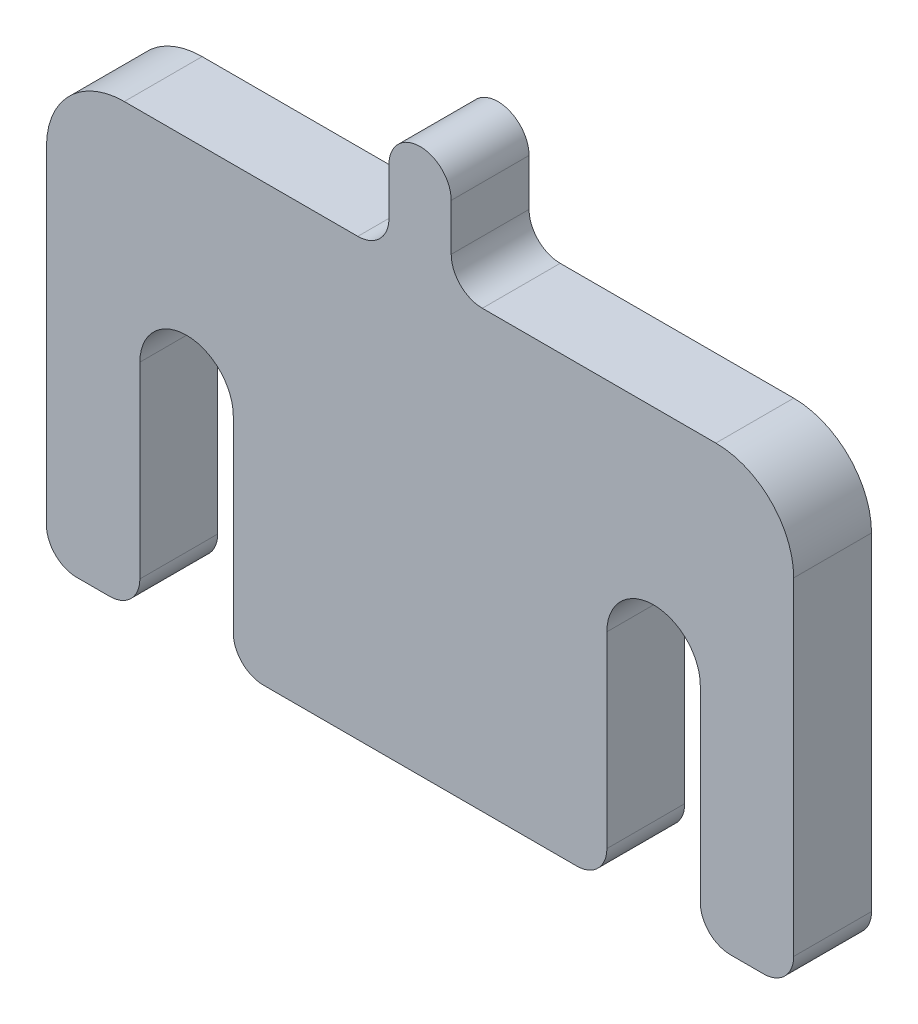
ISO-10303-21;
HEADER;
FILE_DESCRIPTION(('STEP AP214'),'2;1');
FILE_NAME('part.step','',(''),(''),'','','');
FILE_SCHEMA(('AUTOMOTIVE_DESIGN { 1 0 10303 214 1 1 1 1 }'));
ENDSEC;
DATA;
#1=APPLICATION_CONTEXT('core data for automotive mechanical design processes');
#2=APPLICATION_PROTOCOL_DEFINITION('international standard','automotive_design',2000,#1);
#3=PRODUCT_CONTEXT('',#1,'mechanical');
#4=PRODUCT('Part','Part','',(#3));
#5=PRODUCT_RELATED_PRODUCT_CATEGORY('part','',(#4));
#6=PRODUCT_DEFINITION_FORMATION('','',#4);
#7=PRODUCT_DEFINITION_CONTEXT('part definition',#1,'design');
#8=PRODUCT_DEFINITION('design','',#6,#7);
#9=PRODUCT_DEFINITION_SHAPE('','',#8);
#10=(LENGTH_UNIT() NAMED_UNIT(*) SI_UNIT(.MILLI.,.METRE.));
#11=(NAMED_UNIT(*) PLANE_ANGLE_UNIT() SI_UNIT($,.RADIAN.));
#12=(NAMED_UNIT(*) SI_UNIT($,.STERADIAN.) SOLID_ANGLE_UNIT());
#13=UNCERTAINTY_MEASURE_WITH_UNIT(LENGTH_MEASURE(1.E-05),#10,'distance_accuracy_value','');
#14=(GEOMETRIC_REPRESENTATION_CONTEXT(3) GLOBAL_UNCERTAINTY_ASSIGNED_CONTEXT((#13)) GLOBAL_UNIT_ASSIGNED_CONTEXT((#10,
#11,#12)) REPRESENTATION_CONTEXT('',''));
#15=CARTESIAN_POINT('',(0.,0.,0.));
#16=DIRECTION('',(0.,0.,1.));
#17=DIRECTION('',(1.,0.,0.));
#18=AXIS2_PLACEMENT_3D('',#15,#16,#17);
#19=CARTESIAN_POINT('',(0.,14.,5.));
#20=DIRECTION('',(0.,-1.,0.));
#21=DIRECTION('',(1.,0.,0.));
#22=AXIS2_PLACEMENT_3D('',#19,#20,#21);
#23=PLANE('',#22);
#24=DIRECTION('',(-1.,0.,0.));
#25=VECTOR('',#24,1.);
#26=CARTESIAN_POINT('',(0.,14.,0.));
#27=LINE('',#26,#25);
#28=CARTESIAN_POINT('',(19.,14.,0.));
#29=VERTEX_POINT('',#28);
#30=CARTESIAN_POINT('',(4.,14.,0.));
#31=VERTEX_POINT('',#30);
#32=EDGE_CURVE('E239',#29,#31,#27,.T.);
#33=ORIENTED_EDGE('',*,*,#32,.T.);
#34=DIRECTION('',(0.,0.,-1.));
#35=VECTOR('',#34,1.);
#36=CARTESIAN_POINT('',(4.,14.,5.));
#37=LINE('',#36,#35);
#38=CARTESIAN_POINT('',(4.,14.,5.));
#39=VERTEX_POINT('',#38);
#40=EDGE_CURVE('E11',#39,#31,#37,.T.);
#41=ORIENTED_EDGE('',*,*,#40,.F.);
#42=DIRECTION('',(-1.,0.,0.));
#43=VECTOR('',#42,1.);
#44=CARTESIAN_POINT('',(0.,14.,5.));
#45=LINE('',#44,#43);
#46=CARTESIAN_POINT('',(19.,14.,5.));
#47=VERTEX_POINT('',#46);
#48=EDGE_CURVE('E308',#47,#39,#45,.T.);
#49=ORIENTED_EDGE('',*,*,#48,.F.);
#50=DIRECTION('',(0.,0.,-1.));
#51=VECTOR('',#50,1.);
#52=CARTESIAN_POINT('',(19.,14.,5.));
#53=LINE('',#52,#51);
#54=EDGE_CURVE('E235',#47,#29,#53,.T.);
#55=ORIENTED_EDGE('',*,*,#54,.T.);
#56=EDGE_LOOP('',(#33,#41,#49,#55));
#57=FACE_BOUND('',#56,.T.);
#58=ADVANCED_FACE('F36',(#57),#23,.F.);
#59=CARTESIAN_POINT('',(4.,16.,5.));
#60=DIRECTION('',(0.,0.,-1.));
#61=DIRECTION('',(-1.,0.,0.));
#62=AXIS2_PLACEMENT_3D('',#59,#60,#61);
#63=CYLINDRICAL_SURFACE('',#62,2.);
#64=CARTESIAN_POINT('',(4.,16.,0.));
#65=DIRECTION('',(0.,0.,1.));
#66=DIRECTION('',(1.,0.,0.));
#67=AXIS2_PLACEMENT_3D('',#64,#65,#66);
#68=CIRCLE('',#67,2.);
#69=CARTESIAN_POINT('',(2.,16.,0.));
#70=VERTEX_POINT('',#69);
#71=EDGE_CURVE('E242',#31,#70,#68,.F.);
#72=ORIENTED_EDGE('',*,*,#71,.T.);
#73=DIRECTION('',(0.,0.,-1.));
#74=VECTOR('',#73,1.);
#75=CARTESIAN_POINT('',(2.,16.,5.));
#76=LINE('',#75,#74);
#77=CARTESIAN_POINT('',(2.,16.,5.));
#78=VERTEX_POINT('',#77);
#79=EDGE_CURVE('E44',#78,#70,#76,.T.);
#80=ORIENTED_EDGE('',*,*,#79,.F.);
#81=CARTESIAN_POINT('',(4.,16.,5.));
#82=DIRECTION('',(0.,0.,1.));
#83=DIRECTION('',(1.,0.,0.));
#84=AXIS2_PLACEMENT_3D('',#81,#82,#83);
#85=CIRCLE('',#84,2.);
#86=EDGE_CURVE('E149',#39,#78,#85,.F.);
#87=ORIENTED_EDGE('',*,*,#86,.F.);
#88=ORIENTED_EDGE('',*,*,#40,.T.);
#89=EDGE_LOOP('',(#72,#80,#87,#88));
#90=FACE_BOUND('',#89,.T.);
#91=ADVANCED_FACE('F360',(#90),#63,.F.);
#92=CARTESIAN_POINT('',(1.99999999999999,0.,5.));
#93=DIRECTION('',(1.,0.,0.));
#94=DIRECTION('',(0.,1.,0.));
#95=AXIS2_PLACEMENT_3D('',#92,#93,#94);
#96=PLANE('',#95);
#97=DIRECTION('',(0.,-1.,0.));
#98=VECTOR('',#97,1.);
#99=CARTESIAN_POINT('',(1.99999999999999,0.,0.));
#100=LINE('',#99,#98);
#101=CARTESIAN_POINT('',(2.,19.,0.));
#102=VERTEX_POINT('',#101);
#103=EDGE_CURVE('E245',#102,#70,#100,.T.);
#104=ORIENTED_EDGE('',*,*,#103,.F.);
#105=DIRECTION('',(0.,0.,-1.));
#106=VECTOR('',#105,1.);
#107=CARTESIAN_POINT('',(2.,19.,5.));
#108=LINE('',#107,#106);
#109=CARTESIAN_POINT('',(2.,19.,5.));
#110=VERTEX_POINT('',#109);
#111=EDGE_CURVE('E353',#110,#102,#108,.T.);
#112=ORIENTED_EDGE('',*,*,#111,.F.);
#113=DIRECTION('',(0.,-1.,0.));
#114=VECTOR('',#113,1.);
#115=CARTESIAN_POINT('',(1.99999999999999,0.,5.));
#116=LINE('',#115,#114);
#117=EDGE_CURVE('E359',#110,#78,#116,.T.);
#118=ORIENTED_EDGE('',*,*,#117,.T.);
#119=ORIENTED_EDGE('',*,*,#79,.T.);
#120=EDGE_LOOP('',(#104,#112,#118,#119));
#121=FACE_BOUND('',#120,.T.);
#122=ADVANCED_FACE('F357',(#121),#96,.T.);
#123=CARTESIAN_POINT('',(0.,19.,5.));
#124=DIRECTION('',(0.,0.,-1.));
#125=DIRECTION('',(-1.,0.,0.));
#126=AXIS2_PLACEMENT_3D('',#123,#124,#125);
#127=CYLINDRICAL_SURFACE('',#126,2.);
#128=CARTESIAN_POINT('',(0.,19.,0.));
#129=DIRECTION('',(0.,0.,1.));
#130=DIRECTION('',(1.,0.,0.));
#131=AXIS2_PLACEMENT_3D('',#128,#129,#130);
#132=CIRCLE('',#131,2.);
#133=CARTESIAN_POINT('',(-2.,19.,0.));
#134=VERTEX_POINT('',#133);
#135=EDGE_CURVE('E248',#102,#134,#132,.T.);
#136=ORIENTED_EDGE('',*,*,#135,.T.);
#137=DIRECTION('',(0.,0.,-1.));
#138=VECTOR('',#137,1.);
#139=CARTESIAN_POINT('',(-2.,19.,5.));
#140=LINE('',#139,#138);
#141=CARTESIAN_POINT('',(-2.,19.,5.));
#142=VERTEX_POINT('',#141);
#143=EDGE_CURVE('E350',#142,#134,#140,.T.);
#144=ORIENTED_EDGE('',*,*,#143,.F.);
#145=CARTESIAN_POINT('',(0.,19.,5.));
#146=DIRECTION('',(0.,0.,1.));
#147=DIRECTION('',(1.,0.,0.));
#148=AXIS2_PLACEMENT_3D('',#145,#146,#147);
#149=CIRCLE('',#148,2.);
#150=EDGE_CURVE('E379',#110,#142,#149,.T.);
#151=ORIENTED_EDGE('',*,*,#150,.F.);
#152=ORIENTED_EDGE('',*,*,#111,.T.);
#153=EDGE_LOOP('',(#136,#144,#151,#152));
#154=FACE_BOUND('',#153,.T.);
#155=ADVANCED_FACE('F369',(#154),#127,.T.);
#156=CARTESIAN_POINT('',(-1.99999999999999,0.,5.));
#157=DIRECTION('',(1.,0.,0.));
#158=DIRECTION('',(0.,1.,0.));
#159=AXIS2_PLACEMENT_3D('',#156,#157,#158);
#160=PLANE('',#159);
#161=DIRECTION('',(0.,-1.,0.));
#162=VECTOR('',#161,1.);
#163=CARTESIAN_POINT('',(-1.99999999999999,0.,0.));
#164=LINE('',#163,#162);
#165=CARTESIAN_POINT('',(-2.,16.,0.));
#166=VERTEX_POINT('',#165);
#167=EDGE_CURVE('E250',#134,#166,#164,.T.);
#168=ORIENTED_EDGE('',*,*,#167,.T.);
#169=DIRECTION('',(0.,0.,-1.));
#170=VECTOR('',#169,1.);
#171=CARTESIAN_POINT('',(-2.,16.,5.));
#172=LINE('',#171,#170);
#173=CARTESIAN_POINT('',(-2.,16.,5.));
#174=VERTEX_POINT('',#173);
#175=EDGE_CURVE('E348',#174,#166,#172,.T.);
#176=ORIENTED_EDGE('',*,*,#175,.F.);
#177=DIRECTION('',(0.,-1.,0.));
#178=VECTOR('',#177,1.);
#179=CARTESIAN_POINT('',(-1.99999999999999,0.,5.));
#180=LINE('',#179,#178);
#181=EDGE_CURVE('E375',#142,#174,#180,.T.);
#182=ORIENTED_EDGE('',*,*,#181,.F.);
#183=ORIENTED_EDGE('',*,*,#143,.T.);
#184=EDGE_LOOP('',(#168,#176,#182,#183));
#185=FACE_BOUND('',#184,.T.);
#186=ADVANCED_FACE('F373',(#185),#160,.F.);
#187=CARTESIAN_POINT('',(-4.,16.,5.));
#188=DIRECTION('',(0.,0.,-1.));
#189=DIRECTION('',(-1.,0.,0.));
#190=AXIS2_PLACEMENT_3D('',#187,#188,#189);
#191=CYLINDRICAL_SURFACE('',#190,2.);
#192=CARTESIAN_POINT('',(-4.,16.,0.));
#193=DIRECTION('',(0.,0.,1.));
#194=DIRECTION('',(1.,0.,0.));
#195=AXIS2_PLACEMENT_3D('',#192,#193,#194);
#196=CIRCLE('',#195,2.);
#197=CARTESIAN_POINT('',(-4.,14.,0.));
#198=VERTEX_POINT('',#197);
#199=EDGE_CURVE('E253',#198,#166,#196,.T.);
#200=ORIENTED_EDGE('',*,*,#199,.F.);
#201=DIRECTION('',(0.,0.,-1.));
#202=VECTOR('',#201,1.);
#203=CARTESIAN_POINT('',(-4.,14.,5.));
#204=LINE('',#203,#202);
#205=CARTESIAN_POINT('',(-4.,14.,5.));
#206=VERTEX_POINT('',#205);
#207=EDGE_CURVE('E346',#206,#198,#204,.T.);
#208=ORIENTED_EDGE('',*,*,#207,.F.);
#209=CARTESIAN_POINT('',(-4.,16.,5.));
#210=DIRECTION('',(0.,0.,1.));
#211=DIRECTION('',(1.,0.,0.));
#212=AXIS2_PLACEMENT_3D('',#209,#210,#211);
#213=CIRCLE('',#212,2.);
#214=EDGE_CURVE('E378',#206,#174,#213,.T.);
#215=ORIENTED_EDGE('',*,*,#214,.T.);
#216=ORIENTED_EDGE('',*,*,#175,.T.);
#217=EDGE_LOOP('',(#200,#208,#215,#216));
#218=FACE_BOUND('',#217,.T.);
#219=ADVANCED_FACE('F454',(#218),#191,.F.);
#220=CARTESIAN_POINT('',(0.,14.,5.));
#221=DIRECTION('',(0.,-1.,0.));
#222=DIRECTION('',(1.,0.,0.));
#223=AXIS2_PLACEMENT_3D('',#220,#221,#222);
#224=PLANE('',#223);
#225=DIRECTION('',(-1.,0.,0.));
#226=VECTOR('',#225,1.);
#227=CARTESIAN_POINT('',(0.,14.,0.));
#228=LINE('',#227,#226);
#229=CARTESIAN_POINT('',(-19.,14.,0.));
#230=VERTEX_POINT('',#229);
#231=EDGE_CURVE('E256',#198,#230,#228,.T.);
#232=ORIENTED_EDGE('',*,*,#231,.T.);
#233=DIRECTION('',(0.,0.,-1.));
#234=VECTOR('',#233,1.);
#235=CARTESIAN_POINT('',(-19.,14.,5.));
#236=LINE('',#235,#234);
#237=CARTESIAN_POINT('',(-19.,14.,5.));
#238=VERTEX_POINT('',#237);
#239=EDGE_CURVE('E344',#238,#230,#236,.T.);
#240=ORIENTED_EDGE('',*,*,#239,.F.);
#241=DIRECTION('',(-1.,0.,0.));
#242=VECTOR('',#241,1.);
#243=CARTESIAN_POINT('',(0.,14.,5.));
#244=LINE('',#243,#242);
#245=EDGE_CURVE('E381',#206,#238,#244,.T.);
#246=ORIENTED_EDGE('',*,*,#245,.F.);
#247=ORIENTED_EDGE('',*,*,#207,.T.);
#248=EDGE_LOOP('',(#232,#240,#246,#247));
#249=FACE_BOUND('',#248,.T.);
#250=ADVANCED_FACE('F457',(#249),#224,.F.);
#251=CARTESIAN_POINT('',(-19.,9.,5.));
#252=DIRECTION('',(0.,0.,-1.));
#253=DIRECTION('',(-1.,0.,0.));
#254=AXIS2_PLACEMENT_3D('',#251,#252,#253);
#255=CYLINDRICAL_SURFACE('',#254,5.);
#256=CARTESIAN_POINT('',(-19.,9.,0.));
#257=DIRECTION('',(0.,0.,1.));
#258=DIRECTION('',(1.,0.,0.));
#259=AXIS2_PLACEMENT_3D('',#256,#257,#258);
#260=CIRCLE('',#259,5.);
#261=CARTESIAN_POINT('',(-24.,9.,0.));
#262=VERTEX_POINT('',#261);
#263=EDGE_CURVE('E259',#262,#230,#260,.F.);
#264=ORIENTED_EDGE('',*,*,#263,.F.);
#265=DIRECTION('',(0.,0.,-1.));
#266=VECTOR('',#265,1.);
#267=CARTESIAN_POINT('',(-24.,9.,5.));
#268=LINE('',#267,#266);
#269=CARTESIAN_POINT('',(-24.,9.,5.));
#270=VERTEX_POINT('',#269);
#271=EDGE_CURVE('E342',#270,#262,#268,.T.);
#272=ORIENTED_EDGE('',*,*,#271,.F.);
#273=CARTESIAN_POINT('',(-19.,9.,5.));
#274=DIRECTION('',(0.,0.,1.));
#275=DIRECTION('',(1.,0.,0.));
#276=AXIS2_PLACEMENT_3D('',#273,#274,#275);
#277=CIRCLE('',#276,5.);
#278=EDGE_CURVE('E387',#270,#238,#277,.F.);
#279=ORIENTED_EDGE('',*,*,#278,.T.);
#280=ORIENTED_EDGE('',*,*,#239,.T.);
#281=EDGE_LOOP('',(#264,#272,#279,#280));
#282=FACE_BOUND('',#281,.T.);
#283=ADVANCED_FACE('F461',(#282),#255,.T.);
#284=CARTESIAN_POINT('',(-24.,0.,5.));
#285=DIRECTION('',(-1.,0.,0.));
#286=DIRECTION('',(0.,0.,1.));
#287=AXIS2_PLACEMENT_3D('',#284,#285,#286);
#288=PLANE('',#287);
#289=DIRECTION('',(0.,1.,0.));
#290=VECTOR('',#289,1.);
#291=CARTESIAN_POINT('',(-24.,0.,0.));
#292=LINE('',#291,#290);
#293=CARTESIAN_POINT('',(-24.,-12.0597401295921,0.));
#294=VERTEX_POINT('',#293);
#295=EDGE_CURVE('E262',#294,#262,#292,.T.);
#296=ORIENTED_EDGE('',*,*,#295,.F.);
#297=DIRECTION('',(0.,0.,-1.));
#298=VECTOR('',#297,1.);
#299=CARTESIAN_POINT('',(-24.,-12.0597401295921,5.));
#300=LINE('',#299,#298);
#301=CARTESIAN_POINT('',(-24.,-12.0597401295921,5.));
#302=VERTEX_POINT('',#301);
#303=EDGE_CURVE('E340',#302,#294,#300,.T.);
#304=ORIENTED_EDGE('',*,*,#303,.F.);
#305=DIRECTION('',(0.,1.,0.));
#306=VECTOR('',#305,1.);
#307=CARTESIAN_POINT('',(-24.,0.,5.));
#308=LINE('',#307,#306);
#309=EDGE_CURVE('E390',#302,#270,#308,.T.);
#310=ORIENTED_EDGE('',*,*,#309,.T.);
#311=ORIENTED_EDGE('',*,*,#271,.T.);
#312=EDGE_LOOP('',(#296,#304,#310,#311));
#313=FACE_BOUND('',#312,.T.);
#314=ADVANCED_FACE('F465',(#313),#288,.T.);
#315=CARTESIAN_POINT('',(-22.0597401295921,-12.0597401295921,5.));
#316=DIRECTION('',(0.,0.,-1.));
#317=DIRECTION('',(-1.,0.,0.));
#318=AXIS2_PLACEMENT_3D('',#315,#316,#317);
#319=CYLINDRICAL_SURFACE('',#318,1.94025987040791);
#320=CARTESIAN_POINT('',(-22.0597401295921,-12.0597401295921,0.));
#321=DIRECTION('',(0.,0.,1.));
#322=DIRECTION('',(1.,0.,0.));
#323=AXIS2_PLACEMENT_3D('',#320,#321,#322);
#324=CIRCLE('',#323,1.94025987040791);
#325=CARTESIAN_POINT('',(-22.0597401295921,-14.,0.));
#326=VERTEX_POINT('',#325);
#327=EDGE_CURVE('E265',#294,#326,#324,.T.);
#328=ORIENTED_EDGE('',*,*,#327,.T.);
#329=DIRECTION('',(0.,0.,-1.));
#330=VECTOR('',#329,1.);
#331=CARTESIAN_POINT('',(-22.0597401295921,-14.,5.));
#332=LINE('',#331,#330);
#333=CARTESIAN_POINT('',(-22.0597401295921,-14.,5.));
#334=VERTEX_POINT('',#333);
#335=EDGE_CURVE('E338',#334,#326,#332,.T.);
#336=ORIENTED_EDGE('',*,*,#335,.F.);
#337=CARTESIAN_POINT('',(-22.0597401295921,-12.0597401295921,5.));
#338=DIRECTION('',(0.,0.,1.));
#339=DIRECTION('',(1.,0.,0.));
#340=AXIS2_PLACEMENT_3D('',#337,#338,#339);
#341=CIRCLE('',#340,1.94025987040791);
#342=EDGE_CURVE('E393',#302,#334,#341,.T.);
#343=ORIENTED_EDGE('',*,*,#342,.F.);
#344=ORIENTED_EDGE('',*,*,#303,.T.);
#345=EDGE_LOOP('',(#328,#336,#343,#344));
#346=FACE_BOUND('',#345,.T.);
#347=ADVANCED_FACE('F469',(#346),#319,.T.);
#348=CARTESIAN_POINT('',(0.,-14.,5.));
#349=DIRECTION('',(0.,-1.,0.));
#350=DIRECTION('',(0.,0.,-1.));
#351=AXIS2_PLACEMENT_3D('',#348,#349,#350);
#352=PLANE('',#351);
#353=DIRECTION('',(-1.,0.,0.));
#354=VECTOR('',#353,1.);
#355=CARTESIAN_POINT('',(0.,-14.,0.));
#356=LINE('',#355,#354);
#357=CARTESIAN_POINT('',(-19.9402598704079,-14.,0.));
#358=VERTEX_POINT('',#357);
#359=EDGE_CURVE('E268',#358,#326,#356,.T.);
#360=ORIENTED_EDGE('',*,*,#359,.F.);
#361=DIRECTION('',(0.,0.,-1.));
#362=VECTOR('',#361,1.);
#363=CARTESIAN_POINT('',(-19.9402598704079,-14.,5.));
#364=LINE('',#363,#362);
#365=CARTESIAN_POINT('',(-19.9402598704079,-14.,5.));
#366=VERTEX_POINT('',#365);
#367=EDGE_CURVE('E336',#366,#358,#364,.T.);
#368=ORIENTED_EDGE('',*,*,#367,.F.);
#369=DIRECTION('',(-1.,0.,0.));
#370=VECTOR('',#369,1.);
#371=CARTESIAN_POINT('',(0.,-14.,5.));
#372=LINE('',#371,#370);
#373=EDGE_CURVE('E395',#366,#334,#372,.T.);
#374=ORIENTED_EDGE('',*,*,#373,.T.);
#375=ORIENTED_EDGE('',*,*,#335,.T.);
#376=EDGE_LOOP('',(#360,#368,#374,#375));
#377=FACE_BOUND('',#376,.T.);
#378=ADVANCED_FACE('F473',(#377),#352,.T.);
#379=CARTESIAN_POINT('',(-19.9402598704079,-12.0597401295921,5.));
#380=DIRECTION('',(0.,0.,-1.));
#381=DIRECTION('',(-1.,0.,0.));
#382=AXIS2_PLACEMENT_3D('',#379,#380,#381);
#383=CYLINDRICAL_SURFACE('',#382,1.94025987040791);
#384=CARTESIAN_POINT('',(-19.9402598704079,-12.0597401295921,0.));
#385=DIRECTION('',(0.,0.,1.));
#386=DIRECTION('',(1.,0.,0.));
#387=AXIS2_PLACEMENT_3D('',#384,#385,#386);
#388=CIRCLE('',#387,1.94025987040791);
#389=CARTESIAN_POINT('',(-18.,-12.0597401295921,0.));
#390=VERTEX_POINT('',#389);
#391=EDGE_CURVE('E271',#358,#390,#388,.T.);
#392=ORIENTED_EDGE('',*,*,#391,.T.);
#393=DIRECTION('',(0.,0.,-1.));
#394=VECTOR('',#393,1.);
#395=CARTESIAN_POINT('',(-18.,-12.0597401295921,5.));
#396=LINE('',#395,#394);
#397=CARTESIAN_POINT('',(-18.,-12.0597401295921,5.));
#398=VERTEX_POINT('',#397);
#399=EDGE_CURVE('E334',#398,#390,#396,.T.);
#400=ORIENTED_EDGE('',*,*,#399,.F.);
#401=CARTESIAN_POINT('',(-19.9402598704079,-12.0597401295921,5.));
#402=DIRECTION('',(0.,0.,1.));
#403=DIRECTION('',(1.,0.,0.));
#404=AXIS2_PLACEMENT_3D('',#401,#402,#403);
#405=CIRCLE('',#404,1.94025987040791);
#406=EDGE_CURVE('E398',#366,#398,#405,.T.);
#407=ORIENTED_EDGE('',*,*,#406,.F.);
#408=ORIENTED_EDGE('',*,*,#367,.T.);
#409=EDGE_LOOP('',(#392,#400,#407,#408));
#410=FACE_BOUND('',#409,.T.);
#411=ADVANCED_FACE('F477',(#410),#383,.T.);
#412=CARTESIAN_POINT('',(-18.,0.,5.));
#413=DIRECTION('',(1.,0.,0.));
#414=DIRECTION('',(0.,1.,0.));
#415=AXIS2_PLACEMENT_3D('',#412,#413,#414);
#416=PLANE('',#415);
#417=DIRECTION('',(0.,-1.,0.));
#418=VECTOR('',#417,1.);
#419=CARTESIAN_POINT('',(-18.,0.,0.));
#420=LINE('',#419,#418);
#421=CARTESIAN_POINT('',(-18.,0.,0.));
#422=VERTEX_POINT('',#421);
#423=EDGE_CURVE('E274',#422,#390,#420,.T.);
#424=ORIENTED_EDGE('',*,*,#423,.F.);
#425=DIRECTION('',(0.,0.,-1.));
#426=VECTOR('',#425,1.);
#427=CARTESIAN_POINT('',(-18.,0.,5.));
#428=LINE('',#427,#426);
#429=CARTESIAN_POINT('',(-18.,0.,5.));
#430=VERTEX_POINT('',#429);
#431=EDGE_CURVE('E332',#430,#422,#428,.T.);
#432=ORIENTED_EDGE('',*,*,#431,.F.);
#433=DIRECTION('',(0.,-1.,0.));
#434=VECTOR('',#433,1.);
#435=CARTESIAN_POINT('',(-18.,0.,5.));
#436=LINE('',#435,#434);
#437=EDGE_CURVE('E400',#430,#398,#436,.T.);
#438=ORIENTED_EDGE('',*,*,#437,.T.);
#439=ORIENTED_EDGE('',*,*,#399,.T.);
#440=EDGE_LOOP('',(#424,#432,#438,#439));
#441=FACE_BOUND('',#440,.T.);
#442=ADVANCED_FACE('F481',(#441),#416,.T.);
#443=CARTESIAN_POINT('',(-15.,0.,5.));
#444=DIRECTION('',(0.,0.,-1.));
#445=DIRECTION('',(-1.,0.,0.));
#446=AXIS2_PLACEMENT_3D('',#443,#444,#445);
#447=CYLINDRICAL_SURFACE('',#446,3.);
#448=CARTESIAN_POINT('',(-15.,0.,0.));
#449=DIRECTION('',(0.,0.,1.));
#450=DIRECTION('',(1.,0.,0.));
#451=AXIS2_PLACEMENT_3D('',#448,#449,#450);
#452=CIRCLE('',#451,3.);
#453=CARTESIAN_POINT('',(-12.,0.,0.));
#454=VERTEX_POINT('',#453);
#455=EDGE_CURVE('E277',#454,#422,#452,.T.);
#456=ORIENTED_EDGE('',*,*,#455,.F.);
#457=DIRECTION('',(0.,0.,-1.));
#458=VECTOR('',#457,1.);
#459=CARTESIAN_POINT('',(-12.,0.,5.));
#460=LINE('',#459,#458);
#461=CARTESIAN_POINT('',(-12.,0.,5.));
#462=VERTEX_POINT('',#461);
#463=EDGE_CURVE('E330',#462,#454,#460,.T.);
#464=ORIENTED_EDGE('',*,*,#463,.F.);
#465=CARTESIAN_POINT('',(-15.,0.,5.));
#466=DIRECTION('',(0.,0.,1.));
#467=DIRECTION('',(1.,0.,0.));
#468=AXIS2_PLACEMENT_3D('',#465,#466,#467);
#469=CIRCLE('',#468,3.);
#470=EDGE_CURVE('E403',#462,#430,#469,.T.);
#471=ORIENTED_EDGE('',*,*,#470,.T.);
#472=ORIENTED_EDGE('',*,*,#431,.T.);
#473=EDGE_LOOP('',(#456,#464,#471,#472));
#474=FACE_BOUND('',#473,.T.);
#475=ADVANCED_FACE('F485',(#474),#447,.F.);
#476=CARTESIAN_POINT('',(-12.,0.,5.));
#477=DIRECTION('',(1.,0.,0.));
#478=DIRECTION('',(0.,0.,-1.));
#479=AXIS2_PLACEMENT_3D('',#476,#477,#478);
#480=PLANE('',#479);
#481=DIRECTION('',(0.,-1.,0.));
#482=VECTOR('',#481,1.);
#483=CARTESIAN_POINT('',(-12.,0.,0.));
#484=LINE('',#483,#482);
#485=CARTESIAN_POINT('',(-12.,-12.0597401295921,0.));
#486=VERTEX_POINT('',#485);
#487=EDGE_CURVE('E280',#454,#486,#484,.T.);
#488=ORIENTED_EDGE('',*,*,#487,.T.);
#489=DIRECTION('',(0.,0.,-1.));
#490=VECTOR('',#489,1.);
#491=CARTESIAN_POINT('',(-12.,-12.0597401295921,5.));
#492=LINE('',#491,#490);
#493=CARTESIAN_POINT('',(-12.,-12.0597401295921,5.));
#494=VERTEX_POINT('',#493);
#495=EDGE_CURVE('E327',#494,#486,#492,.T.);
#496=ORIENTED_EDGE('',*,*,#495,.F.);
#497=DIRECTION('',(0.,-1.,0.));
#498=VECTOR('',#497,1.);
#499=CARTESIAN_POINT('',(-12.,0.,5.));
#500=LINE('',#499,#498);
#501=EDGE_CURVE('E406',#462,#494,#500,.T.);
#502=ORIENTED_EDGE('',*,*,#501,.F.);
#503=ORIENTED_EDGE('',*,*,#463,.T.);
#504=EDGE_LOOP('',(#488,#496,#502,#503));
#505=FACE_BOUND('',#504,.T.);
#506=ADVANCED_FACE('F489',(#505),#480,.F.);
#507=CARTESIAN_POINT('',(-10.0597401295921,-12.0597401295921,5.));
#508=DIRECTION('',(0.,0.,-1.));
#509=DIRECTION('',(-1.,0.,0.));
#510=AXIS2_PLACEMENT_3D('',#507,#508,#509);
#511=CYLINDRICAL_SURFACE('',#510,1.94025987040791);
#512=CARTESIAN_POINT('',(-10.0597401295921,-12.0597401295921,0.));
#513=DIRECTION('',(0.,0.,1.));
#514=DIRECTION('',(1.,0.,0.));
#515=AXIS2_PLACEMENT_3D('',#512,#513,#514);
#516=CIRCLE('',#515,1.94025987040791);
#517=CARTESIAN_POINT('',(-10.0597401295921,-14.,0.));
#518=VERTEX_POINT('',#517);
#519=EDGE_CURVE('E282',#486,#518,#516,.T.);
#520=ORIENTED_EDGE('',*,*,#519,.T.);
#521=DIRECTION('',(0.,0.,-1.));
#522=VECTOR('',#521,1.);
#523=CARTESIAN_POINT('',(-10.0597401295921,-14.,5.));
#524=LINE('',#523,#522);
#525=CARTESIAN_POINT('',(-10.0597401295921,-14.,5.));
#526=VERTEX_POINT('',#525);
#527=EDGE_CURVE('E325',#526,#518,#524,.T.);
#528=ORIENTED_EDGE('',*,*,#527,.F.);
#529=CARTESIAN_POINT('',(-10.0597401295921,-12.0597401295921,5.));
#530=DIRECTION('',(0.,0.,1.));
#531=DIRECTION('',(1.,0.,0.));
#532=AXIS2_PLACEMENT_3D('',#529,#530,#531);
#533=CIRCLE('',#532,1.94025987040791);
#534=EDGE_CURVE('E408',#494,#526,#533,.T.);
#535=ORIENTED_EDGE('',*,*,#534,.F.);
#536=ORIENTED_EDGE('',*,*,#495,.T.);
#537=EDGE_LOOP('',(#520,#528,#535,#536));
#538=FACE_BOUND('',#537,.T.);
#539=ADVANCED_FACE('F493',(#538),#511,.T.);
#540=CARTESIAN_POINT('',(0.,-14.,5.));
#541=DIRECTION('',(0.,-1.,0.));
#542=DIRECTION('',(1.,0.,0.));
#543=AXIS2_PLACEMENT_3D('',#540,#541,#542);
#544=PLANE('',#543);
#545=DIRECTION('',(-1.,0.,0.));
#546=VECTOR('',#545,1.);
#547=CARTESIAN_POINT('',(0.,-14.,0.));
#548=LINE('',#547,#546);
#549=CARTESIAN_POINT('',(10.0597401295921,-14.,0.));
#550=VERTEX_POINT('',#549);
#551=EDGE_CURVE('E285',#550,#518,#548,.T.);
#552=ORIENTED_EDGE('',*,*,#551,.F.);
#553=DIRECTION('',(0.,0.,-1.));
#554=VECTOR('',#553,1.);
#555=CARTESIAN_POINT('',(10.0597401295921,-14.,5.));
#556=LINE('',#555,#554);
#557=CARTESIAN_POINT('',(10.0597401295921,-14.,5.));
#558=VERTEX_POINT('',#557);
#559=EDGE_CURVE('E323',#558,#550,#556,.T.);
#560=ORIENTED_EDGE('',*,*,#559,.F.);
#561=DIRECTION('',(-1.,0.,0.));
#562=VECTOR('',#561,1.);
#563=CARTESIAN_POINT('',(0.,-14.,5.));
#564=LINE('',#563,#562);
#565=EDGE_CURVE('E410',#558,#526,#564,.T.);
#566=ORIENTED_EDGE('',*,*,#565,.T.);
#567=ORIENTED_EDGE('',*,*,#527,.T.);
#568=EDGE_LOOP('',(#552,#560,#566,#567));
#569=FACE_BOUND('',#568,.T.);
#570=ADVANCED_FACE('F497',(#569),#544,.T.);
#571=CARTESIAN_POINT('',(10.0597401295921,-12.0597401295921,5.));
#572=DIRECTION('',(0.,0.,-1.));
#573=DIRECTION('',(-1.,0.,0.));
#574=AXIS2_PLACEMENT_3D('',#571,#572,#573);
#575=CYLINDRICAL_SURFACE('',#574,1.94025987040791);
#576=CARTESIAN_POINT('',(10.0597401295921,-12.0597401295921,0.));
#577=DIRECTION('',(0.,0.,1.));
#578=DIRECTION('',(1.,0.,0.));
#579=AXIS2_PLACEMENT_3D('',#576,#577,#578);
#580=CIRCLE('',#579,1.94025987040791);
#581=CARTESIAN_POINT('',(12.,-12.0597401295921,0.));
#582=VERTEX_POINT('',#581);
#583=EDGE_CURVE('E288',#550,#582,#580,.T.);
#584=ORIENTED_EDGE('',*,*,#583,.T.);
#585=DIRECTION('',(0.,0.,-1.));
#586=VECTOR('',#585,1.);
#587=CARTESIAN_POINT('',(12.,-12.0597401295921,5.));
#588=LINE('',#587,#586);
#589=CARTESIAN_POINT('',(12.,-12.0597401295921,5.));
#590=VERTEX_POINT('',#589);
#591=EDGE_CURVE('E321',#590,#582,#588,.T.);
#592=ORIENTED_EDGE('',*,*,#591,.F.);
#593=CARTESIAN_POINT('',(10.0597401295921,-12.0597401295921,5.));
#594=DIRECTION('',(0.,0.,1.));
#595=DIRECTION('',(1.,0.,0.));
#596=AXIS2_PLACEMENT_3D('',#593,#594,#595);
#597=CIRCLE('',#596,1.94025987040791);
#598=EDGE_CURVE('E413',#558,#590,#597,.T.);
#599=ORIENTED_EDGE('',*,*,#598,.F.);
#600=ORIENTED_EDGE('',*,*,#559,.T.);
#601=EDGE_LOOP('',(#584,#592,#599,#600));
#602=FACE_BOUND('',#601,.T.);
#603=ADVANCED_FACE('F501',(#602),#575,.T.);
#604=CARTESIAN_POINT('',(12.,0.,5.));
#605=DIRECTION('',(1.,0.,0.));
#606=DIRECTION('',(0.,1.,0.));
#607=AXIS2_PLACEMENT_3D('',#604,#605,#606);
#608=PLANE('',#607);
#609=DIRECTION('',(0.,-1.,0.));
#610=VECTOR('',#609,1.);
#611=CARTESIAN_POINT('',(12.,0.,0.));
#612=LINE('',#611,#610);
#613=CARTESIAN_POINT('',(12.,0.,0.));
#614=VERTEX_POINT('',#613);
#615=EDGE_CURVE('E291',#614,#582,#612,.T.);
#616=ORIENTED_EDGE('',*,*,#615,.F.);
#617=DIRECTION('',(0.,0.,-1.));
#618=VECTOR('',#617,1.);
#619=CARTESIAN_POINT('',(12.,0.,5.));
#620=LINE('',#619,#618);
#621=CARTESIAN_POINT('',(12.,0.,5.));
#622=VERTEX_POINT('',#621);
#623=EDGE_CURVE('E319',#622,#614,#620,.T.);
#624=ORIENTED_EDGE('',*,*,#623,.F.);
#625=DIRECTION('',(0.,-1.,0.));
#626=VECTOR('',#625,1.);
#627=CARTESIAN_POINT('',(12.,0.,5.));
#628=LINE('',#627,#626);
#629=EDGE_CURVE('E415',#622,#590,#628,.T.);
#630=ORIENTED_EDGE('',*,*,#629,.T.);
#631=ORIENTED_EDGE('',*,*,#591,.T.);
#632=EDGE_LOOP('',(#616,#624,#630,#631));
#633=FACE_BOUND('',#632,.T.);
#634=ADVANCED_FACE('F505',(#633),#608,.T.);
#635=CARTESIAN_POINT('',(15.,0.,5.));
#636=DIRECTION('',(0.,0.,-1.));
#637=DIRECTION('',(-1.,0.,0.));
#638=AXIS2_PLACEMENT_3D('',#635,#636,#637);
#639=CYLINDRICAL_SURFACE('',#638,3.);
#640=CARTESIAN_POINT('',(15.,0.,0.));
#641=DIRECTION('',(0.,0.,1.));
#642=DIRECTION('',(1.,0.,0.));
#643=AXIS2_PLACEMENT_3D('',#640,#641,#642);
#644=CIRCLE('',#643,3.);
#645=CARTESIAN_POINT('',(18.,0.,0.));
#646=VERTEX_POINT('',#645);
#647=EDGE_CURVE('E294',#646,#614,#644,.T.);
#648=ORIENTED_EDGE('',*,*,#647,.F.);
#649=DIRECTION('',(0.,0.,-1.));
#650=VECTOR('',#649,1.);
#651=CARTESIAN_POINT('',(18.,0.,5.));
#652=LINE('',#651,#650);
#653=CARTESIAN_POINT('',(18.,0.,5.));
#654=VERTEX_POINT('',#653);
#655=EDGE_CURVE('E317',#654,#646,#652,.T.);
#656=ORIENTED_EDGE('',*,*,#655,.F.);
#657=CARTESIAN_POINT('',(15.,0.,5.));
#658=DIRECTION('',(0.,0.,1.));
#659=DIRECTION('',(1.,0.,0.));
#660=AXIS2_PLACEMENT_3D('',#657,#658,#659);
#661=CIRCLE('',#660,3.);
#662=EDGE_CURVE('E418',#654,#622,#661,.T.);
#663=ORIENTED_EDGE('',*,*,#662,.T.);
#664=ORIENTED_EDGE('',*,*,#623,.T.);
#665=EDGE_LOOP('',(#648,#656,#663,#664));
#666=FACE_BOUND('',#665,.T.);
#667=ADVANCED_FACE('F509',(#666),#639,.F.);
#668=CARTESIAN_POINT('',(18.,0.,5.));
#669=DIRECTION('',(1.,0.,0.));
#670=DIRECTION('',(0.,1.,0.));
#671=AXIS2_PLACEMENT_3D('',#668,#669,#670);
#672=PLANE('',#671);
#673=DIRECTION('',(0.,-1.,0.));
#674=VECTOR('',#673,1.);
#675=CARTESIAN_POINT('',(18.,0.,0.));
#676=LINE('',#675,#674);
#677=CARTESIAN_POINT('',(18.,-12.0597401295921,0.));
#678=VERTEX_POINT('',#677);
#679=EDGE_CURVE('E297',#646,#678,#676,.T.);
#680=ORIENTED_EDGE('',*,*,#679,.T.);
#681=DIRECTION('',(0.,0.,-1.));
#682=VECTOR('',#681,1.);
#683=CARTESIAN_POINT('',(18.,-12.0597401295921,5.));
#684=LINE('',#683,#682);
#685=CARTESIAN_POINT('',(18.,-12.0597401295921,5.));
#686=VERTEX_POINT('',#685);
#687=EDGE_CURVE('E314',#686,#678,#684,.T.);
#688=ORIENTED_EDGE('',*,*,#687,.F.);
#689=DIRECTION('',(0.,-1.,0.));
#690=VECTOR('',#689,1.);
#691=CARTESIAN_POINT('',(18.,0.,5.));
#692=LINE('',#691,#690);
#693=EDGE_CURVE('E421',#654,#686,#692,.T.);
#694=ORIENTED_EDGE('',*,*,#693,.F.);
#695=ORIENTED_EDGE('',*,*,#655,.T.);
#696=EDGE_LOOP('',(#680,#688,#694,#695));
#697=FACE_BOUND('',#696,.T.);
#698=ADVANCED_FACE('F513',(#697),#672,.F.);
#699=CARTESIAN_POINT('',(19.9402598704079,-12.0597401295921,5.));
#700=DIRECTION('',(0.,0.,-1.));
#701=DIRECTION('',(-1.,0.,0.));
#702=AXIS2_PLACEMENT_3D('',#699,#700,#701);
#703=CYLINDRICAL_SURFACE('',#702,1.94025987040791);
#704=CARTESIAN_POINT('',(19.9402598704079,-12.0597401295921,0.));
#705=DIRECTION('',(0.,0.,1.));
#706=DIRECTION('',(1.,0.,0.));
#707=AXIS2_PLACEMENT_3D('',#704,#705,#706);
#708=CIRCLE('',#707,1.94025987040791);
#709=CARTESIAN_POINT('',(19.9402598704079,-14.,0.));
#710=VERTEX_POINT('',#709);
#711=EDGE_CURVE('E299',#678,#710,#708,.T.);
#712=ORIENTED_EDGE('',*,*,#711,.T.);
#713=DIRECTION('',(0.,0.,-1.));
#714=VECTOR('',#713,1.);
#715=CARTESIAN_POINT('',(19.9402598704079,-14.,5.));
#716=LINE('',#715,#714);
#717=CARTESIAN_POINT('',(19.9402598704079,-14.,5.));
#718=VERTEX_POINT('',#717);
#719=EDGE_CURVE('E312',#718,#710,#716,.T.);
#720=ORIENTED_EDGE('',*,*,#719,.F.);
#721=CARTESIAN_POINT('',(19.9402598704079,-12.0597401295921,5.));
#722=DIRECTION('',(0.,0.,1.));
#723=DIRECTION('',(1.,0.,0.));
#724=AXIS2_PLACEMENT_3D('',#721,#722,#723);
#725=CIRCLE('',#724,1.94025987040791);
#726=EDGE_CURVE('E423',#686,#718,#725,.T.);
#727=ORIENTED_EDGE('',*,*,#726,.F.);
#728=ORIENTED_EDGE('',*,*,#687,.T.);
#729=EDGE_LOOP('',(#712,#720,#727,#728));
#730=FACE_BOUND('',#729,.T.);
#731=ADVANCED_FACE('F517',(#730),#703,.T.);
#732=CARTESIAN_POINT('',(0.,-13.9999999999999,5.));
#733=DIRECTION('',(0.,-1.,0.));
#734=DIRECTION('',(1.,0.,0.));
#735=AXIS2_PLACEMENT_3D('',#732,#733,#734);
#736=PLANE('',#735);
#737=DIRECTION('',(-1.,0.,0.));
#738=VECTOR('',#737,1.);
#739=CARTESIAN_POINT('',(0.,-13.9999999999999,0.));
#740=LINE('',#739,#738);
#741=CARTESIAN_POINT('',(22.0597401295921,-14.,0.));
#742=VERTEX_POINT('',#741);
#743=EDGE_CURVE('E302',#742,#710,#740,.T.);
#744=ORIENTED_EDGE('',*,*,#743,.F.);
#745=DIRECTION('',(0.,0.,-1.));
#746=VECTOR('',#745,1.);
#747=CARTESIAN_POINT('',(22.0597401295921,-14.,5.));
#748=LINE('',#747,#746);
#749=CARTESIAN_POINT('',(22.0597401295921,-14.,5.));
#750=VERTEX_POINT('',#749);
#751=EDGE_CURVE('E230',#750,#742,#748,.T.);
#752=ORIENTED_EDGE('',*,*,#751,.F.);
#753=DIRECTION('',(-1.,0.,0.));
#754=VECTOR('',#753,1.);
#755=CARTESIAN_POINT('',(0.,-13.9999999999999,5.));
#756=LINE('',#755,#754);
#757=EDGE_CURVE('E223',#750,#718,#756,.T.);
#758=ORIENTED_EDGE('',*,*,#757,.T.);
#759=ORIENTED_EDGE('',*,*,#719,.T.);
#760=EDGE_LOOP('',(#744,#752,#758,#759));
#761=FACE_BOUND('',#760,.T.);
#762=ADVANCED_FACE('F426',(#761),#736,.T.);
#763=CARTESIAN_POINT('',(22.0597401295921,-12.0597401295921,5.));
#764=DIRECTION('',(0.,0.,-1.));
#765=DIRECTION('',(-1.,0.,0.));
#766=AXIS2_PLACEMENT_3D('',#763,#764,#765);
#767=CYLINDRICAL_SURFACE('',#766,1.94025987040791);
#768=CARTESIAN_POINT('',(22.0597401295921,-12.0597401295921,0.));
#769=DIRECTION('',(0.,0.,1.));
#770=DIRECTION('',(1.,0.,0.));
#771=AXIS2_PLACEMENT_3D('',#768,#769,#770);
#772=CIRCLE('',#771,1.94025987040791);
#773=CARTESIAN_POINT('',(24.,-12.0597401295921,0.));
#774=VERTEX_POINT('',#773);
#775=EDGE_CURVE('E229',#742,#774,#772,.T.);
#776=ORIENTED_EDGE('',*,*,#775,.T.);
#777=DIRECTION('',(0.,0.,-1.));
#778=VECTOR('',#777,1.);
#779=CARTESIAN_POINT('',(24.,-12.0597401295921,5.));
#780=LINE('',#779,#778);
#781=CARTESIAN_POINT('',(24.,-12.0597401295921,5.));
#782=VERTEX_POINT('',#781);
#783=EDGE_CURVE('E226',#782,#774,#780,.T.);
#784=ORIENTED_EDGE('',*,*,#783,.F.);
#785=CARTESIAN_POINT('',(22.0597401295921,-12.0597401295921,5.));
#786=DIRECTION('',(0.,0.,1.));
#787=DIRECTION('',(1.,0.,0.));
#788=AXIS2_PLACEMENT_3D('',#785,#786,#787);
#789=CIRCLE('',#788,1.94025987040791);
#790=EDGE_CURVE('E217',#750,#782,#789,.T.);
#791=ORIENTED_EDGE('',*,*,#790,.F.);
#792=ORIENTED_EDGE('',*,*,#751,.T.);
#793=EDGE_LOOP('',(#776,#784,#791,#792));
#794=FACE_BOUND('',#793,.T.);
#795=ADVANCED_FACE('F227',(#794),#767,.T.);
#796=CARTESIAN_POINT('',(24.,0.,5.));
#797=DIRECTION('',(-1.,0.,0.));
#798=DIRECTION('',(0.,-1.,0.));
#799=AXIS2_PLACEMENT_3D('',#796,#797,#798);
#800=PLANE('',#799);
#801=DIRECTION('',(0.,1.,0.));
#802=VECTOR('',#801,1.);
#803=CARTESIAN_POINT('',(24.,0.,0.));
#804=LINE('',#803,#802);
#805=CARTESIAN_POINT('',(24.,9.,0.));
#806=VERTEX_POINT('',#805);
#807=EDGE_CURVE('E135',#774,#806,#804,.T.);
#808=ORIENTED_EDGE('',*,*,#807,.T.);
#809=DIRECTION('',(0.,0.,-1.));
#810=VECTOR('',#809,1.);
#811=CARTESIAN_POINT('',(24.,9.,5.));
#812=LINE('',#811,#810);
#813=CARTESIAN_POINT('',(24.,9.,5.));
#814=VERTEX_POINT('',#813);
#815=EDGE_CURVE('E231',#814,#806,#812,.T.);
#816=ORIENTED_EDGE('',*,*,#815,.F.);
#817=DIRECTION('',(0.,1.,0.));
#818=VECTOR('',#817,1.);
#819=CARTESIAN_POINT('',(24.,0.,5.));
#820=LINE('',#819,#818);
#821=EDGE_CURVE('E221',#782,#814,#820,.T.);
#822=ORIENTED_EDGE('',*,*,#821,.F.);
#823=ORIENTED_EDGE('',*,*,#783,.T.);
#824=EDGE_LOOP('',(#808,#816,#822,#823));
#825=FACE_BOUND('',#824,.T.);
#826=ADVANCED_FACE('F233',(#825),#800,.F.);
#827=CARTESIAN_POINT('',(19.,9.,5.));
#828=DIRECTION('',(0.,0.,-1.));
#829=DIRECTION('',(-1.,0.,0.));
#830=AXIS2_PLACEMENT_3D('',#827,#828,#829);
#831=CYLINDRICAL_SURFACE('',#830,5.);
#832=CARTESIAN_POINT('',(19.,9.,0.));
#833=DIRECTION('',(0.,0.,1.));
#834=DIRECTION('',(1.,0.,0.));
#835=AXIS2_PLACEMENT_3D('',#832,#833,#834);
#836=CIRCLE('',#835,5.);
#837=EDGE_CURVE('E141',#806,#29,#836,.T.);
#838=ORIENTED_EDGE('',*,*,#837,.T.);
#839=ORIENTED_EDGE('',*,*,#54,.F.);
#840=CARTESIAN_POINT('',(19.,9.,5.));
#841=DIRECTION('',(0.,0.,1.));
#842=DIRECTION('',(1.,0.,0.));
#843=AXIS2_PLACEMENT_3D('',#840,#841,#842);
#844=CIRCLE('',#843,5.);
#845=EDGE_CURVE('E52',#814,#47,#844,.T.);
#846=ORIENTED_EDGE('',*,*,#845,.F.);
#847=ORIENTED_EDGE('',*,*,#815,.T.);
#848=EDGE_LOOP('',(#838,#839,#846,#847));
#849=FACE_BOUND('',#848,.T.);
#850=ADVANCED_FACE('F431',(#849),#831,.T.);
#851=CARTESIAN_POINT('',(0.,0.,5.));
#852=DIRECTION('',(0.,0.,1.));
#853=DIRECTION('',(1.,0.,0.));
#854=AXIS2_PLACEMENT_3D('',#851,#852,#853);
#855=PLANE('',#854);
#856=ORIENTED_EDGE('',*,*,#48,.T.);
#857=ORIENTED_EDGE('',*,*,#86,.T.);
#858=ORIENTED_EDGE('',*,*,#117,.F.);
#859=ORIENTED_EDGE('',*,*,#150,.T.);
#860=ORIENTED_EDGE('',*,*,#181,.T.);
#861=ORIENTED_EDGE('',*,*,#214,.F.);
#862=ORIENTED_EDGE('',*,*,#245,.T.);
#863=ORIENTED_EDGE('',*,*,#278,.F.);
#864=ORIENTED_EDGE('',*,*,#309,.F.);
#865=ORIENTED_EDGE('',*,*,#342,.T.);
#866=ORIENTED_EDGE('',*,*,#373,.F.);
#867=ORIENTED_EDGE('',*,*,#406,.T.);
#868=ORIENTED_EDGE('',*,*,#437,.F.);
#869=ORIENTED_EDGE('',*,*,#470,.F.);
#870=ORIENTED_EDGE('',*,*,#501,.T.);
#871=ORIENTED_EDGE('',*,*,#534,.T.);
#872=ORIENTED_EDGE('',*,*,#565,.F.);
#873=ORIENTED_EDGE('',*,*,#598,.T.);
#874=ORIENTED_EDGE('',*,*,#629,.F.);
#875=ORIENTED_EDGE('',*,*,#662,.F.);
#876=ORIENTED_EDGE('',*,*,#693,.T.);
#877=ORIENTED_EDGE('',*,*,#726,.T.);
#878=ORIENTED_EDGE('',*,*,#757,.F.);
#879=ORIENTED_EDGE('',*,*,#790,.T.);
#880=ORIENTED_EDGE('',*,*,#821,.T.);
#881=ORIENTED_EDGE('',*,*,#845,.T.);
#882=EDGE_LOOP('',(#856,#857,#858,#859,#860,#861,#862,#863,#864,#865,#866,#867,#868,#869,#870,
#871,#872,#873,#874,#875,#876,#877,#878,#879,#880,#881));
#883=FACE_BOUND('',#882,.T.);
#884=ADVANCED_FACE('F219',(#883),#855,.T.);
#885=CARTESIAN_POINT('',(0.,0.,0.));
#886=DIRECTION('',(0.,0.,1.));
#887=DIRECTION('',(1.,0.,0.));
#888=AXIS2_PLACEMENT_3D('',#885,#886,#887);
#889=PLANE('',#888);
#890=ORIENTED_EDGE('',*,*,#32,.F.);
#891=ORIENTED_EDGE('',*,*,#837,.F.);
#892=ORIENTED_EDGE('',*,*,#807,.F.);
#893=ORIENTED_EDGE('',*,*,#775,.F.);
#894=ORIENTED_EDGE('',*,*,#743,.T.);
#895=ORIENTED_EDGE('',*,*,#711,.F.);
#896=ORIENTED_EDGE('',*,*,#679,.F.);
#897=ORIENTED_EDGE('',*,*,#647,.T.);
#898=ORIENTED_EDGE('',*,*,#615,.T.);
#899=ORIENTED_EDGE('',*,*,#583,.F.);
#900=ORIENTED_EDGE('',*,*,#551,.T.);
#901=ORIENTED_EDGE('',*,*,#519,.F.);
#902=ORIENTED_EDGE('',*,*,#487,.F.);
#903=ORIENTED_EDGE('',*,*,#455,.T.);
#904=ORIENTED_EDGE('',*,*,#423,.T.);
#905=ORIENTED_EDGE('',*,*,#391,.F.);
#906=ORIENTED_EDGE('',*,*,#359,.T.);
#907=ORIENTED_EDGE('',*,*,#327,.F.);
#908=ORIENTED_EDGE('',*,*,#295,.T.);
#909=ORIENTED_EDGE('',*,*,#263,.T.);
#910=ORIENTED_EDGE('',*,*,#231,.F.);
#911=ORIENTED_EDGE('',*,*,#199,.T.);
#912=ORIENTED_EDGE('',*,*,#167,.F.);
#913=ORIENTED_EDGE('',*,*,#135,.F.);
#914=ORIENTED_EDGE('',*,*,#103,.T.);
#915=ORIENTED_EDGE('',*,*,#71,.F.);
#916=EDGE_LOOP('',(#890,#891,#892,#893,#894,#895,#896,#897,#898,#899,#900,#901,#902,#903,#904,
#905,#906,#907,#908,#909,#910,#911,#912,#913,#914,#915));
#917=FACE_BOUND('',#916,.T.);
#918=ADVANCED_FACE('F365',(#917),#889,.F.);
#919=CLOSED_SHELL('',(#58,#91,#122,#155,#186,#219,#250,#283,#314,#347,#378,#411,#442,#475,#506,
#539,#570,#603,#634,#667,#698,#731,#762,#795,#826,#850,#884,#918));
#920=MANIFOLD_SOLID_BREP('B2',#919);
#921=ADVANCED_BREP_SHAPE_REPRESENTATION('',(#18,#920),#14);
#922=SHAPE_DEFINITION_REPRESENTATION(#9,#921);
ENDSEC;
END-ISO-10303-21;
